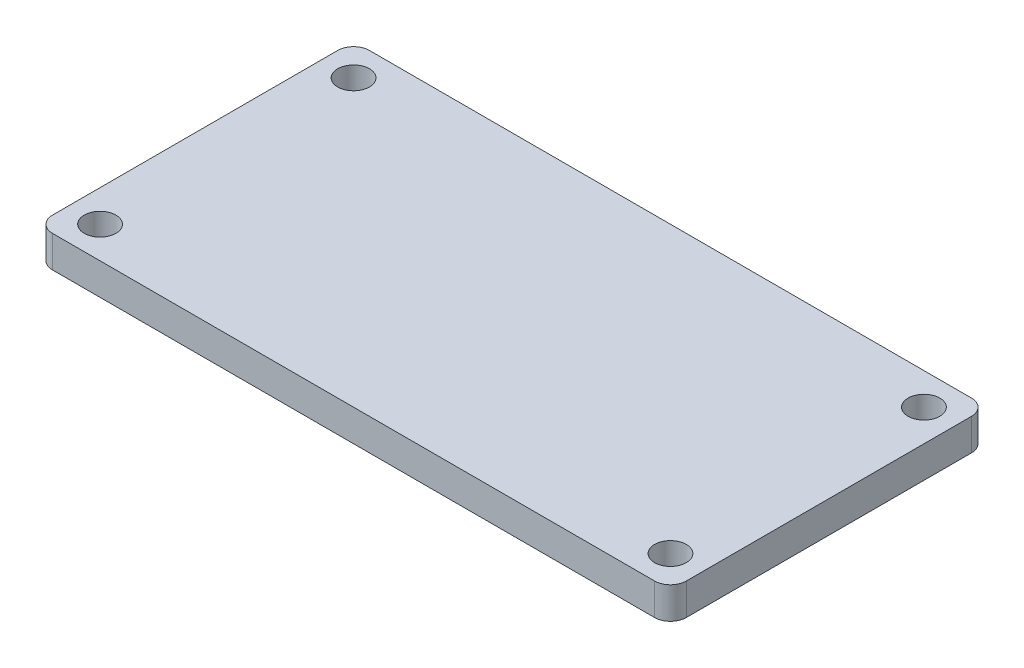
ISO-10303-21;
HEADER;
FILE_DESCRIPTION(('STEP AP214'),'2;1');
FILE_NAME('part.step','',(''),(''),'','','');
FILE_SCHEMA(('AUTOMOTIVE_DESIGN { 1 0 10303 214 1 1 1 1 }'));
ENDSEC;
DATA;
#1=APPLICATION_CONTEXT('core data for automotive mechanical design processes');
#2=APPLICATION_PROTOCOL_DEFINITION('international standard','automotive_design',2000,#1);
#3=PRODUCT_CONTEXT('',#1,'mechanical');
#4=PRODUCT('Part','Part','',(#3));
#5=PRODUCT_RELATED_PRODUCT_CATEGORY('part','',(#4));
#6=PRODUCT_DEFINITION_FORMATION('','',#4);
#7=PRODUCT_DEFINITION_CONTEXT('part definition',#1,'design');
#8=PRODUCT_DEFINITION('design','',#6,#7);
#9=PRODUCT_DEFINITION_SHAPE('','',#8);
#10=(LENGTH_UNIT() NAMED_UNIT(*) SI_UNIT(.MILLI.,.METRE.));
#11=(NAMED_UNIT(*) PLANE_ANGLE_UNIT() SI_UNIT($,.RADIAN.));
#12=(NAMED_UNIT(*) SI_UNIT($,.STERADIAN.) SOLID_ANGLE_UNIT());
#13=UNCERTAINTY_MEASURE_WITH_UNIT(LENGTH_MEASURE(1.E-05),#10,'distance_accuracy_value','');
#14=(GEOMETRIC_REPRESENTATION_CONTEXT(3) GLOBAL_UNCERTAINTY_ASSIGNED_CONTEXT((#13)) GLOBAL_UNIT_ASSIGNED_CONTEXT((#10,
#11,#12)) REPRESENTATION_CONTEXT('',''));
#15=CARTESIAN_POINT('',(0.,0.,0.));
#16=DIRECTION('',(0.,0.,1.));
#17=DIRECTION('',(1.,0.,0.));
#18=AXIS2_PLACEMENT_3D('',#15,#16,#17);
#19=CARTESIAN_POINT('',(95.8921466177455,10.,-138.969332262901));
#20=DIRECTION('',(0.,-1.,0.));
#21=DIRECTION('',(0.,0.,-1.));
#22=AXIS2_PLACEMENT_3D('',#19,#20,#21);
#23=CYLINDRICAL_SURFACE('',#22,5.);
#24=CARTESIAN_POINT('',(95.8921466177455,0.,-138.969332262901));
#25=DIRECTION('',(0.,1.,0.));
#26=DIRECTION('',(0.,0.,1.));
#27=AXIS2_PLACEMENT_3D('',#24,#25,#26);
#28=CIRCLE('',#27,5.);
#29=CARTESIAN_POINT('',(95.8921466177455,0.,-143.969332262901));
#30=VERTEX_POINT('',#29);
#31=CARTESIAN_POINT('',(90.8921466177455,0.,-138.969332262901));
#32=VERTEX_POINT('',#31);
#33=EDGE_CURVE('E134',#30,#32,#28,.T.);
#34=ORIENTED_EDGE('',*,*,#33,.T.);
#35=DIRECTION('',(0.,-1.,0.));
#36=VECTOR('',#35,1.);
#37=CARTESIAN_POINT('',(90.8921466177455,10.,-138.969332262901));
#38=LINE('',#37,#36);
#39=CARTESIAN_POINT('',(90.8921466177455,10.,-138.969332262901));
#40=VERTEX_POINT('',#39);
#41=EDGE_CURVE('E11',#40,#32,#38,.T.);
#42=ORIENTED_EDGE('',*,*,#41,.F.);
#43=CARTESIAN_POINT('',(95.8921466177455,10.,-138.969332262901));
#44=DIRECTION('',(0.,1.,0.));
#45=DIRECTION('',(0.,0.,1.));
#46=AXIS2_PLACEMENT_3D('',#43,#44,#45);
#47=CIRCLE('',#46,5.);
#48=CARTESIAN_POINT('',(95.8921466177455,10.,-143.969332262901));
#49=VERTEX_POINT('',#48);
#50=EDGE_CURVE('E149',#49,#40,#47,.T.);
#51=ORIENTED_EDGE('',*,*,#50,.F.);
#52=DIRECTION('',(0.,-1.,0.));
#53=VECTOR('',#52,1.);
#54=CARTESIAN_POINT('',(95.8921466177455,10.,-143.969332262901));
#55=LINE('',#54,#53);
#56=EDGE_CURVE('E130',#49,#30,#55,.T.);
#57=ORIENTED_EDGE('',*,*,#56,.T.);
#58=EDGE_LOOP('',(#34,#42,#51,#57));
#59=FACE_BOUND('',#58,.T.);
#60=ADVANCED_FACE('F38',(#59),#23,.T.);
#61=CARTESIAN_POINT('',(90.8921466177455,10.,-138.969332262901));
#62=DIRECTION('',(1.,0.,0.));
#63=DIRECTION('',(0.,0.,-1.));
#64=AXIS2_PLACEMENT_3D('',#61,#62,#63);
#65=PLANE('',#64);
#66=DIRECTION('',(0.,0.,1.));
#67=VECTOR('',#66,1.);
#68=CARTESIAN_POINT('',(90.8921466177455,0.,-138.969332262901));
#69=LINE('',#68,#67);
#70=CARTESIAN_POINT('',(90.8921466177455,0.,-48.9693322629012));
#71=VERTEX_POINT('',#70);
#72=EDGE_CURVE('E137',#32,#71,#69,.T.);
#73=ORIENTED_EDGE('',*,*,#72,.T.);
#74=DIRECTION('',(0.,-1.,0.));
#75=VECTOR('',#74,1.);
#76=CARTESIAN_POINT('',(90.8921466177455,10.,-48.9693322629012));
#77=LINE('',#76,#75);
#78=CARTESIAN_POINT('',(90.8921466177455,10.,-48.9693322629012));
#79=VERTEX_POINT('',#78);
#80=EDGE_CURVE('E46',#79,#71,#77,.T.);
#81=ORIENTED_EDGE('',*,*,#80,.F.);
#82=DIRECTION('',(0.,0.,1.));
#83=VECTOR('',#82,1.);
#84=CARTESIAN_POINT('',(90.8921466177455,10.,-138.969332262901));
#85=LINE('',#84,#83);
#86=EDGE_CURVE('E97',#40,#79,#85,.T.);
#87=ORIENTED_EDGE('',*,*,#86,.F.);
#88=ORIENTED_EDGE('',*,*,#41,.T.);
#89=EDGE_LOOP('',(#73,#81,#87,#88));
#90=FACE_BOUND('',#89,.T.);
#91=ADVANCED_FACE('F235',(#90),#65,.F.);
#92=CARTESIAN_POINT('',(95.8921466177455,10.,-48.9693322629012));
#93=DIRECTION('',(0.,-1.,0.));
#94=DIRECTION('',(0.,0.,-1.));
#95=AXIS2_PLACEMENT_3D('',#92,#93,#94);
#96=CYLINDRICAL_SURFACE('',#95,5.);
#97=CARTESIAN_POINT('',(95.8921466177455,0.,-48.9693322629012));
#98=DIRECTION('',(0.,1.,0.));
#99=DIRECTION('',(0.,0.,1.));
#100=AXIS2_PLACEMENT_3D('',#97,#98,#99);
#101=CIRCLE('',#100,5.);
#102=CARTESIAN_POINT('',(95.8921466177455,0.,-43.9693322629012));
#103=VERTEX_POINT('',#102);
#104=EDGE_CURVE('E140',#71,#103,#101,.T.);
#105=ORIENTED_EDGE('',*,*,#104,.T.);
#106=DIRECTION('',(0.,-1.,0.));
#107=VECTOR('',#106,1.);
#108=CARTESIAN_POINT('',(95.8921466177455,10.,-43.9693322629012));
#109=LINE('',#108,#107);
#110=CARTESIAN_POINT('',(95.8921466177455,10.,-43.9693322629012));
#111=VERTEX_POINT('',#110);
#112=EDGE_CURVE('E156',#111,#103,#109,.T.);
#113=ORIENTED_EDGE('',*,*,#112,.F.);
#114=CARTESIAN_POINT('',(95.8921466177455,10.,-48.9693322629012));
#115=DIRECTION('',(0.,1.,0.));
#116=DIRECTION('',(0.,0.,1.));
#117=AXIS2_PLACEMENT_3D('',#114,#115,#116);
#118=CIRCLE('',#117,5.);
#119=EDGE_CURVE('E164',#79,#111,#118,.T.);
#120=ORIENTED_EDGE('',*,*,#119,.F.);
#121=ORIENTED_EDGE('',*,*,#80,.T.);
#122=EDGE_LOOP('',(#105,#113,#120,#121));
#123=FACE_BOUND('',#122,.T.);
#124=ADVANCED_FACE('F162',(#123),#96,.T.);
#125=CARTESIAN_POINT('',(95.8921466177455,10.,-43.9693322629012));
#126=DIRECTION('',(0.,0.,-1.));
#127=DIRECTION('',(-1.,0.,0.));
#128=AXIS2_PLACEMENT_3D('',#125,#126,#127);
#129=PLANE('',#128);
#130=DIRECTION('',(1.,0.,0.));
#131=VECTOR('',#130,1.);
#132=CARTESIAN_POINT('',(95.8921466177455,0.,-43.9693322629012));
#133=LINE('',#132,#131);
#134=CARTESIAN_POINT('',(285.892146617746,0.,-43.9693322629012));
#135=VERTEX_POINT('',#134);
#136=EDGE_CURVE('E142',#103,#135,#133,.T.);
#137=ORIENTED_EDGE('',*,*,#136,.T.);
#138=DIRECTION('',(0.,-1.,0.));
#139=VECTOR('',#138,1.);
#140=CARTESIAN_POINT('',(285.892146617746,10.,-43.9693322629012));
#141=LINE('',#140,#139);
#142=CARTESIAN_POINT('',(285.892146617746,10.,-43.9693322629012));
#143=VERTEX_POINT('',#142);
#144=EDGE_CURVE('E153',#143,#135,#141,.T.);
#145=ORIENTED_EDGE('',*,*,#144,.F.);
#146=DIRECTION('',(1.,0.,0.));
#147=VECTOR('',#146,1.);
#148=CARTESIAN_POINT('',(95.8921466177455,10.,-43.9693322629012));
#149=LINE('',#148,#147);
#150=EDGE_CURVE('E176',#111,#143,#149,.T.);
#151=ORIENTED_EDGE('',*,*,#150,.F.);
#152=ORIENTED_EDGE('',*,*,#112,.T.);
#153=EDGE_LOOP('',(#137,#145,#151,#152));
#154=FACE_BOUND('',#153,.T.);
#155=ADVANCED_FACE('F172',(#154),#129,.F.);
#156=CARTESIAN_POINT('',(285.892146617746,10.,-48.9693322629012));
#157=DIRECTION('',(0.,-1.,0.));
#158=DIRECTION('',(0.,0.,-1.));
#159=AXIS2_PLACEMENT_3D('',#156,#157,#158);
#160=CYLINDRICAL_SURFACE('',#159,5.);
#161=CARTESIAN_POINT('',(285.892146617746,0.,-48.9693322629012));
#162=DIRECTION('',(0.,1.,0.));
#163=DIRECTION('',(0.,0.,1.));
#164=AXIS2_PLACEMENT_3D('',#161,#162,#163);
#165=CIRCLE('',#164,5.);
#166=CARTESIAN_POINT('',(290.892146617746,0.,-48.9693322629012));
#167=VERTEX_POINT('',#166);
#168=EDGE_CURVE('E144',#135,#167,#165,.T.);
#169=ORIENTED_EDGE('',*,*,#168,.T.);
#170=DIRECTION('',(0.,-1.,0.));
#171=VECTOR('',#170,1.);
#172=CARTESIAN_POINT('',(290.892146617746,10.,-48.9693322629012));
#173=LINE('',#172,#171);
#174=CARTESIAN_POINT('',(290.892146617746,10.,-48.9693322629012));
#175=VERTEX_POINT('',#174);
#176=EDGE_CURVE('E125',#175,#167,#173,.T.);
#177=ORIENTED_EDGE('',*,*,#176,.F.);
#178=CARTESIAN_POINT('',(285.892146617746,10.,-48.9693322629012));
#179=DIRECTION('',(0.,1.,0.));
#180=DIRECTION('',(0.,0.,1.));
#181=AXIS2_PLACEMENT_3D('',#178,#179,#180);
#182=CIRCLE('',#181,5.);
#183=EDGE_CURVE('E116',#143,#175,#182,.T.);
#184=ORIENTED_EDGE('',*,*,#183,.F.);
#185=ORIENTED_EDGE('',*,*,#144,.T.);
#186=EDGE_LOOP('',(#169,#177,#184,#185));
#187=FACE_BOUND('',#186,.T.);
#188=ADVANCED_FACE('F175',(#187),#160,.T.);
#189=CARTESIAN_POINT('',(290.892146617746,10.,-48.9693322629012));
#190=DIRECTION('',(-1.,0.,0.));
#191=DIRECTION('',(0.,0.,1.));
#192=AXIS2_PLACEMENT_3D('',#189,#190,#191);
#193=PLANE('',#192);
#194=DIRECTION('',(0.,0.,-1.));
#195=VECTOR('',#194,1.);
#196=CARTESIAN_POINT('',(290.892146617746,0.,-48.9693322629012));
#197=LINE('',#196,#195);
#198=CARTESIAN_POINT('',(290.892146617746,0.,-138.969332262901));
#199=VERTEX_POINT('',#198);
#200=EDGE_CURVE('E124',#167,#199,#197,.T.);
#201=ORIENTED_EDGE('',*,*,#200,.T.);
#202=DIRECTION('',(0.,-1.,0.));
#203=VECTOR('',#202,1.);
#204=CARTESIAN_POINT('',(290.892146617746,10.,-138.969332262901));
#205=LINE('',#204,#203);
#206=CARTESIAN_POINT('',(290.892146617746,10.,-138.969332262901));
#207=VERTEX_POINT('',#206);
#208=EDGE_CURVE('E121',#207,#199,#205,.T.);
#209=ORIENTED_EDGE('',*,*,#208,.F.);
#210=DIRECTION('',(0.,0.,-1.));
#211=VECTOR('',#210,1.);
#212=CARTESIAN_POINT('',(290.892146617746,10.,-48.9693322629012));
#213=LINE('',#212,#211);
#214=EDGE_CURVE('E110',#175,#207,#213,.T.);
#215=ORIENTED_EDGE('',*,*,#214,.F.);
#216=ORIENTED_EDGE('',*,*,#176,.T.);
#217=EDGE_LOOP('',(#201,#209,#215,#216));
#218=FACE_BOUND('',#217,.T.);
#219=ADVANCED_FACE('F122',(#218),#193,.F.);
#220=CARTESIAN_POINT('',(285.892146617746,10.,-138.969332262901));
#221=DIRECTION('',(0.,-1.,0.));
#222=DIRECTION('',(0.,0.,-1.));
#223=AXIS2_PLACEMENT_3D('',#220,#221,#222);
#224=CYLINDRICAL_SURFACE('',#223,5.);
#225=CARTESIAN_POINT('',(285.892146617746,0.,-138.969332262901));
#226=DIRECTION('',(0.,1.,0.));
#227=DIRECTION('',(0.,0.,1.));
#228=AXIS2_PLACEMENT_3D('',#225,#226,#227);
#229=CIRCLE('',#228,5.);
#230=CARTESIAN_POINT('',(285.892146617746,0.,-143.969332262901));
#231=VERTEX_POINT('',#230);
#232=EDGE_CURVE('E83',#199,#231,#229,.T.);
#233=ORIENTED_EDGE('',*,*,#232,.T.);
#234=DIRECTION('',(0.,-1.,0.));
#235=VECTOR('',#234,1.);
#236=CARTESIAN_POINT('',(285.892146617746,10.,-143.969332262901));
#237=LINE('',#236,#235);
#238=CARTESIAN_POINT('',(285.892146617746,10.,-143.969332262901));
#239=VERTEX_POINT('',#238);
#240=EDGE_CURVE('E126',#239,#231,#237,.T.);
#241=ORIENTED_EDGE('',*,*,#240,.F.);
#242=CARTESIAN_POINT('',(285.892146617746,10.,-138.969332262901));
#243=DIRECTION('',(0.,1.,0.));
#244=DIRECTION('',(0.,0.,1.));
#245=AXIS2_PLACEMENT_3D('',#242,#243,#244);
#246=CIRCLE('',#245,5.);
#247=EDGE_CURVE('E114',#207,#239,#246,.T.);
#248=ORIENTED_EDGE('',*,*,#247,.F.);
#249=ORIENTED_EDGE('',*,*,#208,.T.);
#250=EDGE_LOOP('',(#233,#241,#248,#249));
#251=FACE_BOUND('',#250,.T.);
#252=ADVANCED_FACE('F128',(#251),#224,.T.);
#253=CARTESIAN_POINT('',(285.892146617746,10.,-143.969332262901));
#254=DIRECTION('',(0.,0.,1.));
#255=DIRECTION('',(1.,0.,0.));
#256=AXIS2_PLACEMENT_3D('',#253,#254,#255);
#257=PLANE('',#256);
#258=DIRECTION('',(-1.,0.,0.));
#259=VECTOR('',#258,1.);
#260=CARTESIAN_POINT('',(285.892146617746,0.,-143.969332262901));
#261=LINE('',#260,#259);
#262=EDGE_CURVE('E89',#231,#30,#261,.T.);
#263=ORIENTED_EDGE('',*,*,#262,.T.);
#264=ORIENTED_EDGE('',*,*,#56,.F.);
#265=DIRECTION('',(-1.,0.,0.));
#266=VECTOR('',#265,1.);
#267=CARTESIAN_POINT('',(285.892146617746,10.,-143.969332262901));
#268=LINE('',#267,#266);
#269=EDGE_CURVE('E54',#239,#49,#268,.T.);
#270=ORIENTED_EDGE('',*,*,#269,.F.);
#271=ORIENTED_EDGE('',*,*,#240,.T.);
#272=EDGE_LOOP('',(#263,#264,#270,#271));
#273=FACE_BOUND('',#272,.T.);
#274=ADVANCED_FACE('F218',(#273),#257,.F.);
#275=CARTESIAN_POINT('',(95.8921466177455,10.,-138.969332262901));
#276=DIRECTION('',(0.,1.,0.));
#277=DIRECTION('',(0.,0.,1.));
#278=AXIS2_PLACEMENT_3D('',#275,#276,#277);
#279=PLANE('',#278);
#280=CARTESIAN_POINT('',(280.892146617746,10.,-53.9693322629012));
#281=DIRECTION('',(0.,1.,0.));
#282=DIRECTION('',(0.,0.,1.));
#283=AXIS2_PLACEMENT_3D('',#280,#281,#282);
#284=CIRCLE('',#283,4.99999999999999);
#285=CARTESIAN_POINT('',(280.892146617746,10.,-48.9693322629012));
#286=VERTEX_POINT('',#285);
#287=EDGE_CURVE('E188',#286,#286,#284,.T.);
#288=ORIENTED_EDGE('',*,*,#287,.F.);
#289=EDGE_LOOP('',(#288));
#290=FACE_BOUND('',#289,.T.);
#291=CARTESIAN_POINT('',(280.892146617746,10.,-133.969332262901));
#292=DIRECTION('',(0.,1.,0.));
#293=DIRECTION('',(0.,0.,1.));
#294=AXIS2_PLACEMENT_3D('',#291,#292,#293);
#295=CIRCLE('',#294,4.99999999999999);
#296=CARTESIAN_POINT('',(280.892146617746,10.,-128.969332262901));
#297=VERTEX_POINT('',#296);
#298=EDGE_CURVE('E194',#297,#297,#295,.T.);
#299=ORIENTED_EDGE('',*,*,#298,.F.);
#300=EDGE_LOOP('',(#299));
#301=FACE_BOUND('',#300,.T.);
#302=CARTESIAN_POINT('',(100.892146617745,10.,-133.969332262901));
#303=DIRECTION('',(0.,1.,0.));
#304=DIRECTION('',(0.,0.,1.));
#305=AXIS2_PLACEMENT_3D('',#302,#303,#304);
#306=CIRCLE('',#305,5.00000000000001);
#307=CARTESIAN_POINT('',(100.892146617745,10.,-128.969332262901));
#308=VERTEX_POINT('',#307);
#309=EDGE_CURVE('E200',#308,#308,#306,.T.);
#310=ORIENTED_EDGE('',*,*,#309,.F.);
#311=EDGE_LOOP('',(#310));
#312=FACE_BOUND('',#311,.T.);
#313=CARTESIAN_POINT('',(100.892146617745,10.,-53.9693322629012));
#314=DIRECTION('',(0.,1.,0.));
#315=DIRECTION('',(0.,0.,1.));
#316=AXIS2_PLACEMENT_3D('',#313,#314,#315);
#317=CIRCLE('',#316,5.00000000000001);
#318=CARTESIAN_POINT('',(100.892146617745,10.,-48.9693322629012));
#319=VERTEX_POINT('',#318);
#320=EDGE_CURVE('E182',#319,#319,#317,.T.);
#321=ORIENTED_EDGE('',*,*,#320,.F.);
#322=EDGE_LOOP('',(#321));
#323=FACE_BOUND('',#322,.T.);
#324=ORIENTED_EDGE('',*,*,#50,.T.);
#325=ORIENTED_EDGE('',*,*,#86,.T.);
#326=ORIENTED_EDGE('',*,*,#119,.T.);
#327=ORIENTED_EDGE('',*,*,#150,.T.);
#328=ORIENTED_EDGE('',*,*,#183,.T.);
#329=ORIENTED_EDGE('',*,*,#214,.T.);
#330=ORIENTED_EDGE('',*,*,#247,.T.);
#331=ORIENTED_EDGE('',*,*,#269,.T.);
#332=EDGE_LOOP('',(#324,#325,#326,#327,#328,#329,#330,#331));
#333=FACE_BOUND('',#332,.T.);
#334=ADVANCED_FACE('F112',(#290,#301,#312,#323,#333),#279,.T.);
#335=CARTESIAN_POINT('',(95.8921466177455,0.,-138.969332262901));
#336=DIRECTION('',(0.,1.,0.));
#337=DIRECTION('',(0.,0.,1.));
#338=AXIS2_PLACEMENT_3D('',#335,#336,#337);
#339=PLANE('',#338);
#340=CARTESIAN_POINT('',(280.892146617746,0.,-53.9693322629012));
#341=DIRECTION('',(0.,1.,0.));
#342=DIRECTION('',(0.,0.,1.));
#343=AXIS2_PLACEMENT_3D('',#340,#341,#342);
#344=CIRCLE('',#343,4.99999999999999);
#345=CARTESIAN_POINT('',(280.892146617746,0.,-48.9693322629012));
#346=VERTEX_POINT('',#345);
#347=EDGE_CURVE('E191',#346,#346,#344,.T.);
#348=ORIENTED_EDGE('',*,*,#347,.T.);
#349=EDGE_LOOP('',(#348));
#350=FACE_BOUND('',#349,.T.);
#351=CARTESIAN_POINT('',(280.892146617746,0.,-133.969332262901));
#352=DIRECTION('',(0.,1.,0.));
#353=DIRECTION('',(0.,0.,1.));
#354=AXIS2_PLACEMENT_3D('',#351,#352,#353);
#355=CIRCLE('',#354,4.99999999999999);
#356=CARTESIAN_POINT('',(280.892146617746,0.,-128.969332262901));
#357=VERTEX_POINT('',#356);
#358=EDGE_CURVE('E197',#357,#357,#355,.T.);
#359=ORIENTED_EDGE('',*,*,#358,.T.);
#360=EDGE_LOOP('',(#359));
#361=FACE_BOUND('',#360,.T.);
#362=CARTESIAN_POINT('',(100.892146617745,0.,-133.969332262901));
#363=DIRECTION('',(0.,1.,0.));
#364=DIRECTION('',(0.,0.,1.));
#365=AXIS2_PLACEMENT_3D('',#362,#363,#364);
#366=CIRCLE('',#365,5.00000000000001);
#367=CARTESIAN_POINT('',(100.892146617745,0.,-128.969332262901));
#368=VERTEX_POINT('',#367);
#369=EDGE_CURVE('E185',#368,#368,#366,.T.);
#370=ORIENTED_EDGE('',*,*,#369,.T.);
#371=EDGE_LOOP('',(#370));
#372=FACE_BOUND('',#371,.T.);
#373=CARTESIAN_POINT('',(100.892146617745,0.,-53.9693322629012));
#374=DIRECTION('',(0.,1.,0.));
#375=DIRECTION('',(0.,0.,1.));
#376=AXIS2_PLACEMENT_3D('',#373,#374,#375);
#377=CIRCLE('',#376,5.00000000000001);
#378=CARTESIAN_POINT('',(100.892146617745,0.,-48.9693322629012));
#379=VERTEX_POINT('',#378);
#380=EDGE_CURVE('E138',#379,#379,#377,.T.);
#381=ORIENTED_EDGE('',*,*,#380,.T.);
#382=EDGE_LOOP('',(#381));
#383=FACE_BOUND('',#382,.T.);
#384=ORIENTED_EDGE('',*,*,#33,.F.);
#385=ORIENTED_EDGE('',*,*,#262,.F.);
#386=ORIENTED_EDGE('',*,*,#232,.F.);
#387=ORIENTED_EDGE('',*,*,#200,.F.);
#388=ORIENTED_EDGE('',*,*,#168,.F.);
#389=ORIENTED_EDGE('',*,*,#136,.F.);
#390=ORIENTED_EDGE('',*,*,#104,.F.);
#391=ORIENTED_EDGE('',*,*,#72,.F.);
#392=EDGE_LOOP('',(#384,#385,#386,#387,#388,#389,#390,#391));
#393=FACE_BOUND('',#392,.T.);
#394=ADVANCED_FACE('F168',(#350,#361,#372,#383,#393),#339,.F.);
#395=CARTESIAN_POINT('',(100.892146617745,0.,-53.9693322629012));
#396=DIRECTION('',(0.,1.,0.));
#397=DIRECTION('',(0.,0.,1.));
#398=AXIS2_PLACEMENT_3D('',#395,#396,#397);
#399=CYLINDRICAL_SURFACE('',#398,5.00000000000001);
#400=ORIENTED_EDGE('',*,*,#380,.F.);
#401=EDGE_LOOP('',(#400));
#402=FACE_BOUND('',#401,.T.);
#403=ORIENTED_EDGE('',*,*,#320,.T.);
#404=EDGE_LOOP('',(#403));
#405=FACE_BOUND('',#404,.T.);
#406=ADVANCED_FACE('F212',(#402,#405),#399,.F.);
#407=CARTESIAN_POINT('',(100.892146617745,0.,-133.969332262901));
#408=DIRECTION('',(0.,1.,0.));
#409=DIRECTION('',(0.,0.,1.));
#410=AXIS2_PLACEMENT_3D('',#407,#408,#409);
#411=CYLINDRICAL_SURFACE('',#410,5.00000000000001);
#412=ORIENTED_EDGE('',*,*,#369,.F.);
#413=EDGE_LOOP('',(#412));
#414=FACE_BOUND('',#413,.T.);
#415=ORIENTED_EDGE('',*,*,#309,.T.);
#416=EDGE_LOOP('',(#415));
#417=FACE_BOUND('',#416,.T.);
#418=ADVANCED_FACE('F208',(#414,#417),#411,.F.);
#419=CARTESIAN_POINT('',(280.892146617746,0.,-133.969332262901));
#420=DIRECTION('',(0.,1.,0.));
#421=DIRECTION('',(0.,0.,1.));
#422=AXIS2_PLACEMENT_3D('',#419,#420,#421);
#423=CYLINDRICAL_SURFACE('',#422,4.99999999999999);
#424=ORIENTED_EDGE('',*,*,#358,.F.);
#425=EDGE_LOOP('',(#424));
#426=FACE_BOUND('',#425,.T.);
#427=ORIENTED_EDGE('',*,*,#298,.T.);
#428=EDGE_LOOP('',(#427));
#429=FACE_BOUND('',#428,.T.);
#430=ADVANCED_FACE('F211',(#426,#429),#423,.F.);
#431=CARTESIAN_POINT('',(280.892146617746,0.,-53.9693322629012));
#432=DIRECTION('',(0.,1.,0.));
#433=DIRECTION('',(0.,0.,1.));
#434=AXIS2_PLACEMENT_3D('',#431,#432,#433);
#435=CYLINDRICAL_SURFACE('',#434,4.99999999999999);
#436=ORIENTED_EDGE('',*,*,#347,.F.);
#437=EDGE_LOOP('',(#436));
#438=FACE_BOUND('',#437,.T.);
#439=ORIENTED_EDGE('',*,*,#287,.T.);
#440=EDGE_LOOP('',(#439));
#441=FACE_BOUND('',#440,.T.);
#442=ADVANCED_FACE('F306',(#438,#441),#435,.F.);
#443=CLOSED_SHELL('',(#60,#91,#124,#155,#188,#219,#252,#274,#334,#394,#406,#418,#430,#442));
#444=MANIFOLD_SOLID_BREP('B2',#443);
#445=ADVANCED_BREP_SHAPE_REPRESENTATION('',(#18,#444),#14);
#446=SHAPE_DEFINITION_REPRESENTATION(#9,#445);
ENDSEC;
END-ISO-10303-21;
